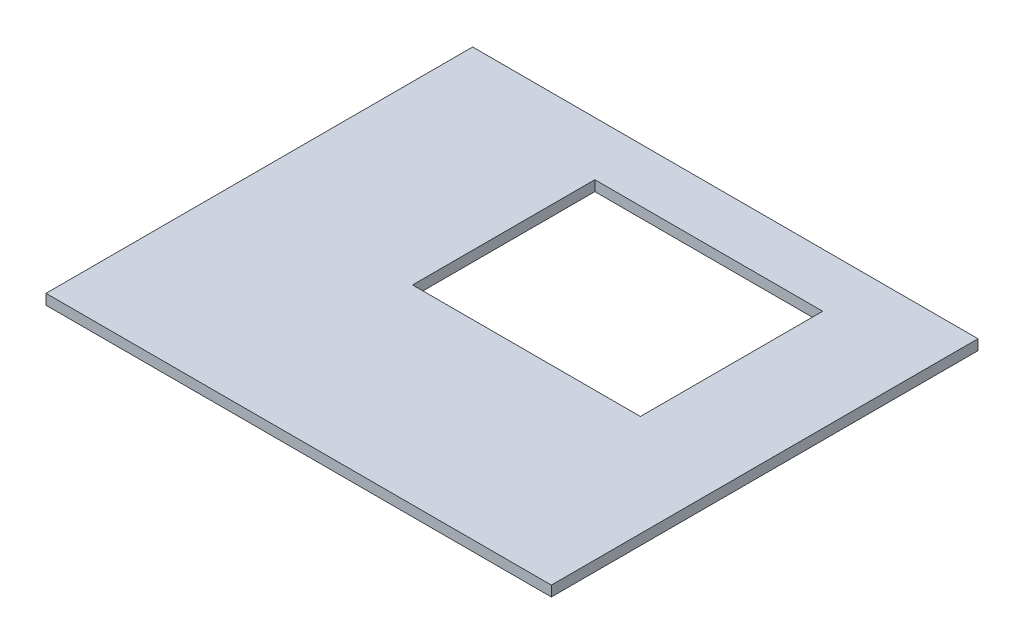
ISO-10303-21;
HEADER;
FILE_DESCRIPTION(('STEP AP214'),'2;1');
FILE_NAME('part.step','',(''),(''),'','','');
FILE_SCHEMA(('AUTOMOTIVE_DESIGN { 1 0 10303 214 1 1 1 1 }'));
ENDSEC;
DATA;
#1=APPLICATION_CONTEXT('core data for automotive mechanical design processes');
#2=APPLICATION_PROTOCOL_DEFINITION('international standard','automotive_design',2000,#1);
#3=PRODUCT_CONTEXT('',#1,'mechanical');
#4=PRODUCT('Part','Part','',(#3));
#5=PRODUCT_RELATED_PRODUCT_CATEGORY('part','',(#4));
#6=PRODUCT_DEFINITION_FORMATION('','',#4);
#7=PRODUCT_DEFINITION_CONTEXT('part definition',#1,'design');
#8=PRODUCT_DEFINITION('design','',#6,#7);
#9=PRODUCT_DEFINITION_SHAPE('','',#8);
#10=(LENGTH_UNIT() NAMED_UNIT(*) SI_UNIT(.MILLI.,.METRE.));
#11=(NAMED_UNIT(*) PLANE_ANGLE_UNIT() SI_UNIT($,.RADIAN.));
#12=(NAMED_UNIT(*) SI_UNIT($,.STERADIAN.) SOLID_ANGLE_UNIT());
#13=UNCERTAINTY_MEASURE_WITH_UNIT(LENGTH_MEASURE(1.E-05),#10,'distance_accuracy_value','');
#14=(GEOMETRIC_REPRESENTATION_CONTEXT(3) GLOBAL_UNCERTAINTY_ASSIGNED_CONTEXT((#13)) GLOBAL_UNIT_ASSIGNED_CONTEXT((#10,
#11,#12)) REPRESENTATION_CONTEXT('',''));
#15=CARTESIAN_POINT('',(0.,0.,0.));
#16=DIRECTION('',(0.,0.,1.));
#17=DIRECTION('',(1.,0.,0.));
#18=AXIS2_PLACEMENT_3D('',#15,#16,#17);
#19=CARTESIAN_POINT('',(61.,0.,51.5));
#20=DIRECTION('',(0.,0.,-1.));
#21=DIRECTION('',(-1.,0.,0.));
#22=AXIS2_PLACEMENT_3D('',#19,#20,#21);
#23=PLANE('',#22);
#24=DIRECTION('',(0.,-1.,0.));
#25=VECTOR('',#24,1.);
#26=CARTESIAN_POINT('',(61.,1.25,51.5));
#27=LINE('',#26,#25);
#28=CARTESIAN_POINT('',(61.,2.5,51.5));
#29=VERTEX_POINT('',#28);
#30=CARTESIAN_POINT('',(61.,0.,51.5));
#31=VERTEX_POINT('',#30);
#32=EDGE_CURVE('E89',#29,#31,#27,.T.);
#33=ORIENTED_EDGE('',*,*,#32,.F.);
#34=DIRECTION('',(-1.,0.,0.));
#35=VECTOR('',#34,1.);
#36=CARTESIAN_POINT('',(0.,2.5,51.5));
#37=LINE('',#36,#35);
#38=CARTESIAN_POINT('',(-61.,2.5,51.5));
#39=VERTEX_POINT('',#38);
#40=EDGE_CURVE('E106',#29,#39,#37,.T.);
#41=ORIENTED_EDGE('',*,*,#40,.T.);
#42=DIRECTION('',(0.,1.,0.));
#43=VECTOR('',#42,1.);
#44=CARTESIAN_POINT('',(-61.,1.25,51.5));
#45=LINE('',#44,#43);
#46=CARTESIAN_POINT('',(-61.,0.,51.5));
#47=VERTEX_POINT('',#46);
#48=EDGE_CURVE('E140',#47,#39,#45,.T.);
#49=ORIENTED_EDGE('',*,*,#48,.F.);
#50=DIRECTION('',(-1.,0.,0.));
#51=VECTOR('',#50,1.);
#52=CARTESIAN_POINT('',(0.,0.,51.5));
#53=LINE('',#52,#51);
#54=EDGE_CURVE('E133',#31,#47,#53,.T.);
#55=ORIENTED_EDGE('',*,*,#54,.F.);
#56=EDGE_LOOP('',(#33,#41,#49,#55));
#57=FACE_BOUND('',#56,.T.);
#58=ADVANCED_FACE('F17',(#57),#23,.F.);
#59=CARTESIAN_POINT('',(36.5,0.,5.5));
#60=DIRECTION('',(1.,0.,0.));
#61=DIRECTION('',(0.,0.,-1.));
#62=AXIS2_PLACEMENT_3D('',#59,#60,#61);
#63=PLANE('',#62);
#64=DIRECTION('',(0.,1.,0.));
#65=VECTOR('',#64,1.);
#66=CARTESIAN_POINT('',(36.5,1.25,5.5));
#67=LINE('',#66,#65);
#68=CARTESIAN_POINT('',(36.500000004,0.,5.4999999935));
#69=VERTEX_POINT('',#68);
#70=CARTESIAN_POINT('',(36.500000004,2.5,5.4999999935));
#71=VERTEX_POINT('',#70);
#72=EDGE_CURVE('E90',#69,#71,#67,.T.);
#73=ORIENTED_EDGE('',*,*,#72,.T.);
#74=DIRECTION('',(0.,0.,-1.));
#75=VECTOR('',#74,1.);
#76=CARTESIAN_POINT('',(36.500000016,2.5,0.));
#77=LINE('',#76,#75);
#78=CARTESIAN_POINT('',(36.500000004,2.5,-38.500000006));
#79=VERTEX_POINT('',#78);
#80=EDGE_CURVE('E101',#71,#79,#77,.T.);
#81=ORIENTED_EDGE('',*,*,#80,.T.);
#82=DIRECTION('',(0.,-1.,0.));
#83=VECTOR('',#82,1.);
#84=CARTESIAN_POINT('',(36.5,1.25,-38.5));
#85=LINE('',#84,#83);
#86=CARTESIAN_POINT('',(36.500000004,0.,-38.500000006));
#87=VERTEX_POINT('',#86);
#88=EDGE_CURVE('E21',#79,#87,#85,.T.);
#89=ORIENTED_EDGE('',*,*,#88,.T.);
#90=DIRECTION('',(0.,0.,-1.));
#91=VECTOR('',#90,1.);
#92=CARTESIAN_POINT('',(36.500000016,0.,0.));
#93=LINE('',#92,#91);
#94=EDGE_CURVE('E122',#69,#87,#93,.T.);
#95=ORIENTED_EDGE('',*,*,#94,.F.);
#96=EDGE_LOOP('',(#73,#81,#89,#95));
#97=FACE_BOUND('',#96,.T.);
#98=ADVANCED_FACE('F121',(#97),#63,.F.);
#99=CARTESIAN_POINT('',(36.5,0.,-38.5));
#100=DIRECTION('',(0.,0.,-1.));
#101=DIRECTION('',(-1.,0.,0.));
#102=AXIS2_PLACEMENT_3D('',#99,#100,#101);
#103=PLANE('',#102);
#104=ORIENTED_EDGE('',*,*,#88,.F.);
#105=DIRECTION('',(-1.,0.,0.));
#106=VECTOR('',#105,1.);
#107=CARTESIAN_POINT('',(0.,2.5,-38.500000024));
#108=LINE('',#107,#106);
#109=CARTESIAN_POINT('',(-18.499999992,2.5,-38.500000006));
#110=VERTEX_POINT('',#109);
#111=EDGE_CURVE('E142',#79,#110,#108,.T.);
#112=ORIENTED_EDGE('',*,*,#111,.T.);
#113=DIRECTION('',(0.,-1.,0.));
#114=VECTOR('',#113,1.);
#115=CARTESIAN_POINT('',(-18.5,1.25,-38.5));
#116=LINE('',#115,#114);
#117=CARTESIAN_POINT('',(-18.499999992,0.,-38.500000006));
#118=VERTEX_POINT('',#117);
#119=EDGE_CURVE('E105',#110,#118,#116,.T.);
#120=ORIENTED_EDGE('',*,*,#119,.T.);
#121=DIRECTION('',(-1.,0.,0.));
#122=VECTOR('',#121,1.);
#123=CARTESIAN_POINT('',(0.,0.,-38.500000024));
#124=LINE('',#123,#122);
#125=EDGE_CURVE('E123',#87,#118,#124,.T.);
#126=ORIENTED_EDGE('',*,*,#125,.F.);
#127=EDGE_LOOP('',(#104,#112,#120,#126));
#128=FACE_BOUND('',#127,.T.);
#129=ADVANCED_FACE('F124',(#128),#103,.F.);
#130=CARTESIAN_POINT('',(-18.5,0.,-38.5));
#131=DIRECTION('',(-1.,0.,0.));
#132=DIRECTION('',(0.,0.,1.));
#133=AXIS2_PLACEMENT_3D('',#130,#131,#132);
#134=PLANE('',#133);
#135=ORIENTED_EDGE('',*,*,#119,.F.);
#136=DIRECTION('',(0.,0.,1.));
#137=VECTOR('',#136,1.);
#138=CARTESIAN_POINT('',(-18.499999968,2.5,0.));
#139=LINE('',#138,#137);
#140=CARTESIAN_POINT('',(-18.499999992,2.5,5.4999999935));
#141=VERTEX_POINT('',#140);
#142=EDGE_CURVE('E98',#110,#141,#139,.T.);
#143=ORIENTED_EDGE('',*,*,#142,.T.);
#144=DIRECTION('',(0.,-1.,0.));
#145=VECTOR('',#144,1.);
#146=CARTESIAN_POINT('',(-18.5,1.25,5.5));
#147=LINE('',#146,#145);
#148=CARTESIAN_POINT('',(-18.499999992,0.,5.4999999935));
#149=VERTEX_POINT('',#148);
#150=EDGE_CURVE('E80',#141,#149,#147,.T.);
#151=ORIENTED_EDGE('',*,*,#150,.T.);
#152=DIRECTION('',(0.,0.,1.));
#153=VECTOR('',#152,1.);
#154=CARTESIAN_POINT('',(-18.499999968,0.,0.));
#155=LINE('',#154,#153);
#156=EDGE_CURVE('E126',#118,#149,#155,.T.);
#157=ORIENTED_EDGE('',*,*,#156,.F.);
#158=EDGE_LOOP('',(#135,#143,#151,#157));
#159=FACE_BOUND('',#158,.T.);
#160=ADVANCED_FACE('F103',(#159),#134,.F.);
#161=CARTESIAN_POINT('',(-18.5,0.,5.5));
#162=DIRECTION('',(0.,0.,1.));
#163=DIRECTION('',(1.,0.,0.));
#164=AXIS2_PLACEMENT_3D('',#161,#162,#163);
#165=PLANE('',#164);
#166=ORIENTED_EDGE('',*,*,#150,.F.);
#167=DIRECTION('',(1.,0.,0.));
#168=VECTOR('',#167,1.);
#169=CARTESIAN_POINT('',(0.,2.5,5.499999974));
#170=LINE('',#169,#168);
#171=EDGE_CURVE('E83',#141,#71,#170,.T.);
#172=ORIENTED_EDGE('',*,*,#171,.T.);
#173=ORIENTED_EDGE('',*,*,#72,.F.);
#174=DIRECTION('',(1.,0.,0.));
#175=VECTOR('',#174,1.);
#176=CARTESIAN_POINT('',(0.,0.,5.499999974));
#177=LINE('',#176,#175);
#178=EDGE_CURVE('E85',#149,#69,#177,.T.);
#179=ORIENTED_EDGE('',*,*,#178,.F.);
#180=EDGE_LOOP('',(#166,#172,#173,#179));
#181=FACE_BOUND('',#180,.T.);
#182=ADVANCED_FACE('F82',(#181),#165,.F.);
#183=CARTESIAN_POINT('',(61.,0.,51.5));
#184=DIRECTION('',(1.,0.,0.));
#185=DIRECTION('',(0.,0.,-1.));
#186=AXIS2_PLACEMENT_3D('',#183,#184,#185);
#187=PLANE('',#186);
#188=DIRECTION('',(0.,1.,0.));
#189=VECTOR('',#188,1.);
#190=CARTESIAN_POINT('',(61.,1.25,-51.5));
#191=LINE('',#190,#189);
#192=CARTESIAN_POINT('',(61.,0.,-51.5));
#193=VERTEX_POINT('',#192);
#194=CARTESIAN_POINT('',(61.,2.5,-51.5));
#195=VERTEX_POINT('',#194);
#196=EDGE_CURVE('E158',#193,#195,#191,.T.);
#197=ORIENTED_EDGE('',*,*,#196,.T.);
#198=DIRECTION('',(0.,0.,1.));
#199=VECTOR('',#198,1.);
#200=CARTESIAN_POINT('',(61.,2.5,0.));
#201=LINE('',#200,#199);
#202=EDGE_CURVE('E109',#195,#29,#201,.T.);
#203=ORIENTED_EDGE('',*,*,#202,.T.);
#204=ORIENTED_EDGE('',*,*,#32,.T.);
#205=DIRECTION('',(0.,0.,1.));
#206=VECTOR('',#205,1.);
#207=CARTESIAN_POINT('',(61.,0.,0.));
#208=LINE('',#207,#206);
#209=EDGE_CURVE('E135',#193,#31,#208,.T.);
#210=ORIENTED_EDGE('',*,*,#209,.F.);
#211=EDGE_LOOP('',(#197,#203,#204,#210));
#212=FACE_BOUND('',#211,.T.);
#213=ADVANCED_FACE('F166',(#212),#187,.T.);
#214=CARTESIAN_POINT('',(-61.,2.5,51.5));
#215=DIRECTION('',(0.,-1.,0.));
#216=DIRECTION('',(0.,0.,-1.));
#217=AXIS2_PLACEMENT_3D('',#214,#215,#216);
#218=PLANE('',#217);
#219=ORIENTED_EDGE('',*,*,#80,.F.);
#220=ORIENTED_EDGE('',*,*,#171,.F.);
#221=ORIENTED_EDGE('',*,*,#142,.F.);
#222=ORIENTED_EDGE('',*,*,#111,.F.);
#223=EDGE_LOOP('',(#219,#220,#221,#222));
#224=FACE_BOUND('',#223,.T.);
#225=ORIENTED_EDGE('',*,*,#202,.F.);
#226=DIRECTION('',(-1.,0.,0.));
#227=VECTOR('',#226,1.);
#228=CARTESIAN_POINT('',(0.,2.5,-51.5));
#229=LINE('',#228,#227);
#230=CARTESIAN_POINT('',(-61.,2.5,-51.5));
#231=VERTEX_POINT('',#230);
#232=EDGE_CURVE('E155',#195,#231,#229,.T.);
#233=ORIENTED_EDGE('',*,*,#232,.T.);
#234=DIRECTION('',(0.,0.,-1.));
#235=VECTOR('',#234,1.);
#236=CARTESIAN_POINT('',(-61.,2.5,0.));
#237=LINE('',#236,#235);
#238=EDGE_CURVE('E138',#39,#231,#237,.T.);
#239=ORIENTED_EDGE('',*,*,#238,.F.);
#240=ORIENTED_EDGE('',*,*,#40,.F.);
#241=EDGE_LOOP('',(#225,#233,#239,#240));
#242=FACE_BOUND('',#241,.T.);
#243=ADVANCED_FACE('F95',(#224,#242),#218,.F.);
#244=CARTESIAN_POINT('',(-61.,0.,-51.5));
#245=DIRECTION('',(-1.,0.,0.));
#246=DIRECTION('',(0.,0.,1.));
#247=AXIS2_PLACEMENT_3D('',#244,#245,#246);
#248=PLANE('',#247);
#249=ORIENTED_EDGE('',*,*,#48,.T.);
#250=ORIENTED_EDGE('',*,*,#238,.T.);
#251=DIRECTION('',(0.,-1.,0.));
#252=VECTOR('',#251,1.);
#253=CARTESIAN_POINT('',(-61.,1.25,-51.5));
#254=LINE('',#253,#252);
#255=CARTESIAN_POINT('',(-61.,0.,-51.5));
#256=VERTEX_POINT('',#255);
#257=EDGE_CURVE('E27',#231,#256,#254,.T.);
#258=ORIENTED_EDGE('',*,*,#257,.T.);
#259=DIRECTION('',(0.,0.,-1.));
#260=VECTOR('',#259,1.);
#261=CARTESIAN_POINT('',(-61.,0.,0.));
#262=LINE('',#261,#260);
#263=EDGE_CURVE('E35',#47,#256,#262,.T.);
#264=ORIENTED_EDGE('',*,*,#263,.F.);
#265=EDGE_LOOP('',(#249,#250,#258,#264));
#266=FACE_BOUND('',#265,.T.);
#267=ADVANCED_FACE('F145',(#266),#248,.T.);
#268=CARTESIAN_POINT('',(-61.,0.,51.5));
#269=DIRECTION('',(0.,-1.,0.));
#270=DIRECTION('',(0.,0.,-1.));
#271=AXIS2_PLACEMENT_3D('',#268,#269,#270);
#272=PLANE('',#271);
#273=ORIENTED_EDGE('',*,*,#156,.T.);
#274=ORIENTED_EDGE('',*,*,#178,.T.);
#275=ORIENTED_EDGE('',*,*,#94,.T.);
#276=ORIENTED_EDGE('',*,*,#125,.T.);
#277=EDGE_LOOP('',(#273,#274,#275,#276));
#278=FACE_BOUND('',#277,.T.);
#279=ORIENTED_EDGE('',*,*,#54,.T.);
#280=ORIENTED_EDGE('',*,*,#263,.T.);
#281=DIRECTION('',(1.,0.,0.));
#282=VECTOR('',#281,1.);
#283=CARTESIAN_POINT('',(0.,0.,-51.5));
#284=LINE('',#283,#282);
#285=EDGE_CURVE('E11',#256,#193,#284,.T.);
#286=ORIENTED_EDGE('',*,*,#285,.T.);
#287=ORIENTED_EDGE('',*,*,#209,.T.);
#288=EDGE_LOOP('',(#279,#280,#286,#287));
#289=FACE_BOUND('',#288,.T.);
#290=ADVANCED_FACE('F162',(#278,#289),#272,.T.);
#291=CARTESIAN_POINT('',(-61.,0.,-51.5));
#292=DIRECTION('',(0.,0.,1.));
#293=DIRECTION('',(1.,0.,0.));
#294=AXIS2_PLACEMENT_3D('',#291,#292,#293);
#295=PLANE('',#294);
#296=ORIENTED_EDGE('',*,*,#257,.F.);
#297=ORIENTED_EDGE('',*,*,#232,.F.);
#298=ORIENTED_EDGE('',*,*,#196,.F.);
#299=ORIENTED_EDGE('',*,*,#285,.F.);
#300=EDGE_LOOP('',(#296,#297,#298,#299));
#301=FACE_BOUND('',#300,.T.);
#302=ADVANCED_FACE('F19',(#301),#295,.F.);
#303=CLOSED_SHELL('',(#58,#98,#129,#160,#182,#213,#243,#267,#290,#302));
#304=MANIFOLD_SOLID_BREP('B1',#303);
#305=ADVANCED_BREP_SHAPE_REPRESENTATION('',(#18,#304),#14);
#306=SHAPE_DEFINITION_REPRESENTATION(#9,#305);
ENDSEC;
END-ISO-10303-21;
